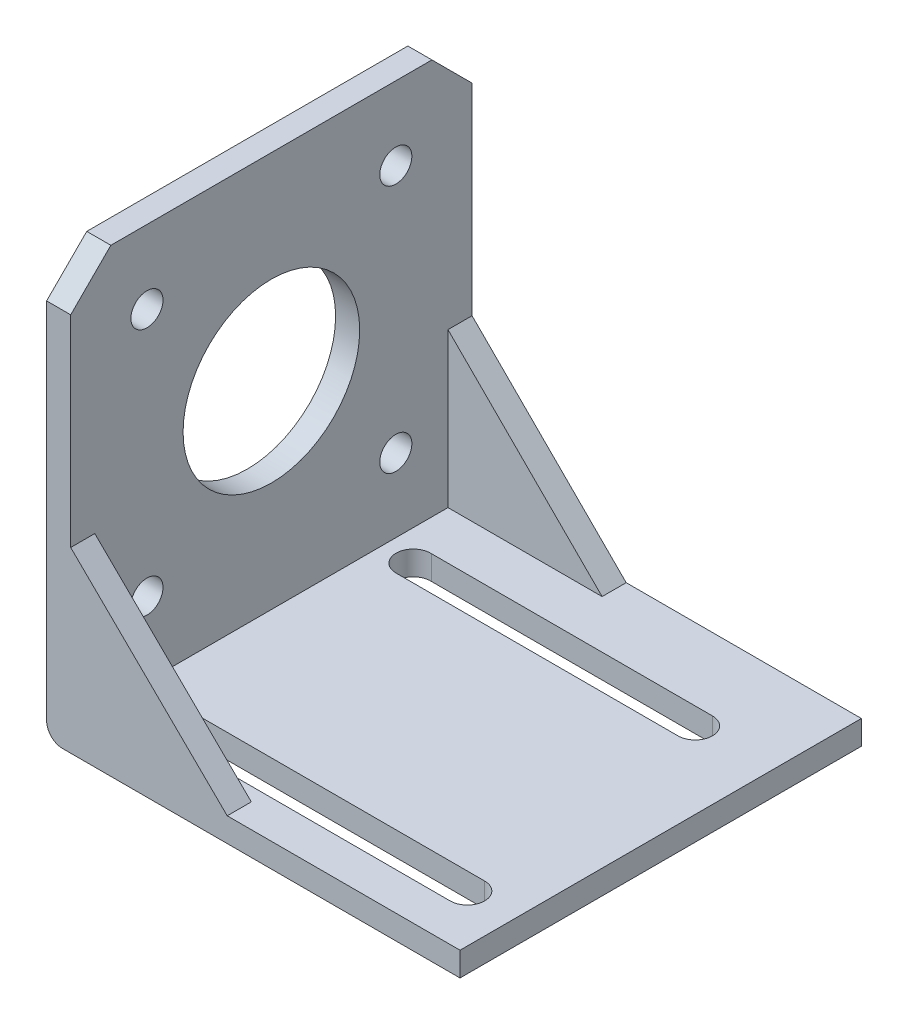
ISO-10303-21;
HEADER;
FILE_DESCRIPTION(('STEP AP214'),'2;1');
FILE_NAME('part.step','',(''),(''),'','','');
FILE_SCHEMA(('AUTOMOTIVE_DESIGN { 1 0 10303 214 1 1 1 1 }'));
ENDSEC;
DATA;
#1=APPLICATION_CONTEXT('core data for automotive mechanical design processes');
#2=APPLICATION_PROTOCOL_DEFINITION('international standard','automotive_design',2000,#1);
#3=PRODUCT_CONTEXT('',#1,'mechanical');
#4=PRODUCT('Part','Part','',(#3));
#5=PRODUCT_RELATED_PRODUCT_CATEGORY('part','',(#4));
#6=PRODUCT_DEFINITION_FORMATION('','',#4);
#7=PRODUCT_DEFINITION_CONTEXT('part definition',#1,'design');
#8=PRODUCT_DEFINITION('design','',#6,#7);
#9=PRODUCT_DEFINITION_SHAPE('','',#8);
#10=(LENGTH_UNIT() NAMED_UNIT(*) SI_UNIT(.MILLI.,.METRE.));
#11=(NAMED_UNIT(*) PLANE_ANGLE_UNIT() SI_UNIT($,.RADIAN.));
#12=(NAMED_UNIT(*) SI_UNIT($,.STERADIAN.) SOLID_ANGLE_UNIT());
#13=UNCERTAINTY_MEASURE_WITH_UNIT(LENGTH_MEASURE(1.E-05),#10,'distance_accuracy_value','');
#14=(GEOMETRIC_REPRESENTATION_CONTEXT(3) GLOBAL_UNCERTAINTY_ASSIGNED_CONTEXT((#13)) GLOBAL_UNIT_ASSIGNED_CONTEXT((#10,
#11,#12)) REPRESENTATION_CONTEXT('',''));
#15=CARTESIAN_POINT('',(0.,0.,0.));
#16=DIRECTION('',(0.,0.,1.));
#17=DIRECTION('',(1.,0.,0.));
#18=AXIS2_PLACEMENT_3D('',#15,#16,#17);
#19=CARTESIAN_POINT('',(48.5,0.,50.));
#20=DIRECTION('',(0.,-1.,0.));
#21=DIRECTION('',(1.,0.,0.));
#22=AXIS2_PLACEMENT_3D('',#19,#20,#21);
#23=PLANE('',#22);
#24=CARTESIAN_POINT('',(38.9492272097224,0.,11.15));
#25=DIRECTION('',(0.,-1.,0.));
#26=DIRECTION('',(1.,0.,0.));
#27=AXIS2_PLACEMENT_3D('',#24,#25,#26);
#28=CIRCLE('',#27,2.15);
#29=CARTESIAN_POINT('',(38.9492272097224,0.,13.3));
#30=VERTEX_POINT('',#29);
#31=CARTESIAN_POINT('',(38.9492272097224,0.,9.));
#32=VERTEX_POINT('',#31);
#33=EDGE_CURVE('E231',#30,#32,#28,.F.);
#34=ORIENTED_EDGE('',*,*,#33,.F.);
#35=DIRECTION('',(-1.,0.,0.));
#36=VECTOR('',#35,1.);
#37=CARTESIAN_POINT('',(48.5,0.,13.3));
#38=LINE('',#37,#36);
#39=CARTESIAN_POINT('',(3.82888231812455,0.,13.3));
#40=VERTEX_POINT('',#39);
#41=EDGE_CURVE('E234',#30,#40,#38,.T.);
#42=ORIENTED_EDGE('',*,*,#41,.T.);
#43=CARTESIAN_POINT('',(3.82888231812456,0.,11.1488570501058));
#44=DIRECTION('',(0.,-1.,0.));
#45=DIRECTION('',(1.,0.,0.));
#46=AXIS2_PLACEMENT_3D('',#43,#44,#45);
#47=CIRCLE('',#46,2.15114294989423);
#48=CARTESIAN_POINT('',(3.92802549282869,0.,9.));
#49=VERTEX_POINT('',#48);
#50=EDGE_CURVE('E222',#40,#49,#47,.T.);
#51=ORIENTED_EDGE('',*,*,#50,.T.);
#52=DIRECTION('',(-1.,0.,0.));
#53=VECTOR('',#52,1.);
#54=CARTESIAN_POINT('',(48.5,0.,9.));
#55=LINE('',#54,#53);
#56=EDGE_CURVE('E197',#32,#49,#55,.T.);
#57=ORIENTED_EDGE('',*,*,#56,.F.);
#58=EDGE_LOOP('',(#34,#42,#51,#57));
#59=FACE_BOUND('',#58,.T.);
#60=CARTESIAN_POINT('',(3.03967271372915,0.,43.15));
#61=DIRECTION('',(0.,-1.,0.));
#62=DIRECTION('',(1.,0.,0.));
#63=AXIS2_PLACEMENT_3D('',#60,#61,#62);
#64=CIRCLE('',#63,2.15);
#65=CARTESIAN_POINT('',(3.03967271372915,0.,45.3));
#66=VERTEX_POINT('',#65);
#67=CARTESIAN_POINT('',(3.03967271372916,0.,41.));
#68=VERTEX_POINT('',#67);
#69=EDGE_CURVE('E274',#66,#68,#64,.T.);
#70=ORIENTED_EDGE('',*,*,#69,.T.);
#71=DIRECTION('',(1.,0.,0.));
#72=VECTOR('',#71,1.);
#73=CARTESIAN_POINT('',(48.5,0.,41.));
#74=LINE('',#73,#72);
#75=CARTESIAN_POINT('',(42.5713713836583,0.,41.));
#76=VERTEX_POINT('',#75);
#77=EDGE_CURVE('E278',#68,#76,#74,.T.);
#78=ORIENTED_EDGE('',*,*,#77,.T.);
#79=CARTESIAN_POINT('',(42.5713713836583,0.,43.15));
#80=DIRECTION('',(0.,-1.,0.));
#81=DIRECTION('',(1.,0.,0.));
#82=AXIS2_PLACEMENT_3D('',#79,#80,#81);
#83=CIRCLE('',#82,2.15);
#84=CARTESIAN_POINT('',(42.5713713836583,0.,45.3));
#85=VERTEX_POINT('',#84);
#86=EDGE_CURVE('E257',#76,#85,#83,.T.);
#87=ORIENTED_EDGE('',*,*,#86,.T.);
#88=DIRECTION('',(1.,0.,0.));
#89=VECTOR('',#88,1.);
#90=CARTESIAN_POINT('',(48.5,0.,45.3));
#91=LINE('',#90,#89);
#92=EDGE_CURVE('E270',#66,#85,#91,.T.);
#93=ORIENTED_EDGE('',*,*,#92,.F.);
#94=EDGE_LOOP('',(#70,#78,#87,#93));
#95=FACE_BOUND('',#94,.T.);
#96=DIRECTION('',(-1.,0.,0.));
#97=VECTOR('',#96,1.);
#98=CARTESIAN_POINT('',(48.5,0.,0.));
#99=LINE('',#98,#97);
#100=CARTESIAN_POINT('',(48.5,0.,0.));
#101=VERTEX_POINT('',#100);
#102=CARTESIAN_POINT('',(19.2,0.,0.));
#103=VERTEX_POINT('',#102);
#104=EDGE_CURVE('E347',#101,#103,#99,.T.);
#105=ORIENTED_EDGE('',*,*,#104,.T.);
#106=DIRECTION('',(0.,0.,-1.));
#107=VECTOR('',#106,1.);
#108=CARTESIAN_POINT('',(19.2,0.,50.));
#109=LINE('',#108,#107);
#110=CARTESIAN_POINT('',(19.2,0.,3.));
#111=VERTEX_POINT('',#110);
#112=EDGE_CURVE('E317',#103,#111,#109,.F.);
#113=ORIENTED_EDGE('',*,*,#112,.T.);
#114=DIRECTION('',(-1.,0.,0.));
#115=VECTOR('',#114,1.);
#116=CARTESIAN_POINT('',(48.5,0.,3.));
#117=LINE('',#116,#115);
#118=CARTESIAN_POINT('',(0.,0.,3.));
#119=VERTEX_POINT('',#118);
#120=EDGE_CURVE('E323',#111,#119,#117,.T.);
#121=ORIENTED_EDGE('',*,*,#120,.T.);
#122=DIRECTION('',(0.,0.,-1.));
#123=VECTOR('',#122,1.);
#124=CARTESIAN_POINT('',(0.,0.,50.));
#125=LINE('',#124,#123);
#126=CARTESIAN_POINT('',(0.,0.,47.));
#127=VERTEX_POINT('',#126);
#128=EDGE_CURVE('E396',#127,#119,#125,.T.);
#129=ORIENTED_EDGE('',*,*,#128,.F.);
#130=DIRECTION('',(-1.,0.,0.));
#131=VECTOR('',#130,1.);
#132=CARTESIAN_POINT('',(48.5,0.,47.));
#133=LINE('',#132,#131);
#134=CARTESIAN_POINT('',(19.5,0.,47.));
#135=VERTEX_POINT('',#134);
#136=EDGE_CURVE('E344',#135,#127,#133,.T.);
#137=ORIENTED_EDGE('',*,*,#136,.F.);
#138=DIRECTION('',(0.,0.,-1.));
#139=VECTOR('',#138,1.);
#140=CARTESIAN_POINT('',(19.5,0.,50.));
#141=LINE('',#140,#139);
#142=CARTESIAN_POINT('',(19.5,0.,50.));
#143=VERTEX_POINT('',#142);
#144=EDGE_CURVE('E337',#135,#143,#141,.F.);
#145=ORIENTED_EDGE('',*,*,#144,.T.);
#146=DIRECTION('',(-1.,0.,0.));
#147=VECTOR('',#146,1.);
#148=CARTESIAN_POINT('',(48.5,0.,50.));
#149=LINE('',#148,#147);
#150=CARTESIAN_POINT('',(48.5,0.,50.));
#151=VERTEX_POINT('',#150);
#152=EDGE_CURVE('E348',#151,#143,#149,.T.);
#153=ORIENTED_EDGE('',*,*,#152,.F.);
#154=DIRECTION('',(0.,0.,-1.));
#155=VECTOR('',#154,1.);
#156=CARTESIAN_POINT('',(48.5,0.,50.));
#157=LINE('',#156,#155);
#158=EDGE_CURVE('E366',#151,#101,#157,.T.);
#159=ORIENTED_EDGE('',*,*,#158,.T.);
#160=EDGE_LOOP('',(#105,#113,#121,#129,#137,#145,#153,#159));
#161=FACE_BOUND('',#160,.T.);
#162=ADVANCED_FACE('F47',(#59,#95,#161),#23,.F.);
#163=CARTESIAN_POINT('',(0.,0.,50.));
#164=DIRECTION('',(-1.,0.,0.));
#165=DIRECTION('',(0.,-1.,0.));
#166=AXIS2_PLACEMENT_3D('',#163,#164,#165);
#167=PLANE('',#166);
#168=CARTESIAN_POINT('',(0.,40.15,9.49999999999999));
#169=DIRECTION('',(1.,0.,0.));
#170=DIRECTION('',(0.,1.,0.));
#171=AXIS2_PLACEMENT_3D('',#168,#169,#170);
#172=CIRCLE('',#171,2.);
#173=CARTESIAN_POINT('',(0.,42.15,9.49999999999999));
#174=VERTEX_POINT('',#173);
#175=EDGE_CURVE('E283',#174,#174,#172,.T.);
#176=ORIENTED_EDGE('',*,*,#175,.F.);
#177=EDGE_LOOP('',(#176));
#178=FACE_BOUND('',#177,.T.);
#179=CARTESIAN_POINT('',(0.,40.15,40.5));
#180=DIRECTION('',(1.,0.,0.));
#181=DIRECTION('',(0.,1.,0.));
#182=AXIS2_PLACEMENT_3D('',#179,#180,#181);
#183=CIRCLE('',#182,2.);
#184=CARTESIAN_POINT('',(0.,42.15,40.5));
#185=VERTEX_POINT('',#184);
#186=EDGE_CURVE('E288',#185,#185,#183,.T.);
#187=ORIENTED_EDGE('',*,*,#186,.F.);
#188=EDGE_LOOP('',(#187));
#189=FACE_BOUND('',#188,.T.);
#190=CARTESIAN_POINT('',(0.,9.15,9.49999999999999));
#191=DIRECTION('',(1.,0.,0.));
#192=DIRECTION('',(0.,1.,0.));
#193=AXIS2_PLACEMENT_3D('',#190,#191,#192);
#194=CIRCLE('',#193,2.);
#195=CARTESIAN_POINT('',(0.,11.15,9.49999999999999));
#196=VERTEX_POINT('',#195);
#197=EDGE_CURVE('E292',#196,#196,#194,.T.);
#198=ORIENTED_EDGE('',*,*,#197,.F.);
#199=EDGE_LOOP('',(#198));
#200=FACE_BOUND('',#199,.T.);
#201=CARTESIAN_POINT('',(0.,9.15,40.5));
#202=DIRECTION('',(1.,0.,0.));
#203=DIRECTION('',(0.,1.,0.));
#204=AXIS2_PLACEMENT_3D('',#201,#202,#203);
#205=CIRCLE('',#204,2.);
#206=CARTESIAN_POINT('',(0.,11.15,40.5));
#207=VERTEX_POINT('',#206);
#208=EDGE_CURVE('E282',#207,#207,#205,.T.);
#209=ORIENTED_EDGE('',*,*,#208,.F.);
#210=EDGE_LOOP('',(#209));
#211=FACE_BOUND('',#210,.T.);
#212=CARTESIAN_POINT('',(0.,24.65,25.));
#213=DIRECTION('',(1.,0.,0.));
#214=DIRECTION('',(0.,1.,0.));
#215=AXIS2_PLACEMENT_3D('',#212,#213,#214);
#216=CIRCLE('',#215,11.);
#217=CARTESIAN_POINT('',(0.,35.65,25.));
#218=VERTEX_POINT('',#217);
#219=EDGE_CURVE('E299',#218,#218,#216,.T.);
#220=ORIENTED_EDGE('',*,*,#219,.F.);
#221=EDGE_LOOP('',(#220));
#222=FACE_BOUND('',#221,.T.);
#223=DIRECTION('',(0.,1.,0.));
#224=VECTOR('',#223,1.);
#225=CARTESIAN_POINT('',(0.,0.,0.));
#226=LINE('',#225,#224);
#227=CARTESIAN_POINT('',(0.,19.2,0.));
#228=VERTEX_POINT('',#227);
#229=CARTESIAN_POINT('',(0.,44.3,0.));
#230=VERTEX_POINT('',#229);
#231=EDGE_CURVE('E369',#228,#230,#226,.T.);
#232=ORIENTED_EDGE('',*,*,#231,.T.);
#233=DIRECTION('',(0.,0.707106781186549,0.707106781186547));
#234=VECTOR('',#233,1.);
#235=CARTESIAN_POINT('',(0.,49.3,5.));
#236=LINE('',#235,#234);
#237=CARTESIAN_POINT('',(0.,49.3,5.));
#238=VERTEX_POINT('',#237);
#239=EDGE_CURVE('E56',#230,#238,#236,.T.);
#240=ORIENTED_EDGE('',*,*,#239,.T.);
#241=DIRECTION('',(0.,0.,-1.));
#242=VECTOR('',#241,1.);
#243=CARTESIAN_POINT('',(0.,49.3,50.));
#244=LINE('',#243,#242);
#245=CARTESIAN_POINT('',(0.,49.3,45.));
#246=VERTEX_POINT('',#245);
#247=EDGE_CURVE('E392',#246,#238,#244,.T.);
#248=ORIENTED_EDGE('',*,*,#247,.F.);
#249=DIRECTION('',(0.,0.707106781186546,-0.707106781186549));
#250=VECTOR('',#249,1.);
#251=CARTESIAN_POINT('',(0.,44.3,50.));
#252=LINE('',#251,#250);
#253=CARTESIAN_POINT('',(0.,44.3,50.));
#254=VERTEX_POINT('',#253);
#255=EDGE_CURVE('E448',#246,#254,#252,.F.);
#256=ORIENTED_EDGE('',*,*,#255,.T.);
#257=DIRECTION('',(0.,1.,0.));
#258=VECTOR('',#257,1.);
#259=CARTESIAN_POINT('',(0.,0.,50.));
#260=LINE('',#259,#258);
#261=CARTESIAN_POINT('',(0.,19.2,50.));
#262=VERTEX_POINT('',#261);
#263=EDGE_CURVE('E352',#262,#254,#260,.T.);
#264=ORIENTED_EDGE('',*,*,#263,.F.);
#265=DIRECTION('',(0.,0.,1.));
#266=VECTOR('',#265,1.);
#267=CARTESIAN_POINT('',(0.,19.2,50.));
#268=LINE('',#267,#266);
#269=CARTESIAN_POINT('',(0.,19.2,47.));
#270=VERTEX_POINT('',#269);
#271=EDGE_CURVE('E330',#262,#270,#268,.F.);
#272=ORIENTED_EDGE('',*,*,#271,.T.);
#273=DIRECTION('',(0.,1.,0.));
#274=VECTOR('',#273,1.);
#275=CARTESIAN_POINT('',(0.,0.,47.));
#276=LINE('',#275,#274);
#277=EDGE_CURVE('E341',#127,#270,#276,.T.);
#278=ORIENTED_EDGE('',*,*,#277,.F.);
#279=ORIENTED_EDGE('',*,*,#128,.T.);
#280=DIRECTION('',(0.,1.,0.));
#281=VECTOR('',#280,1.);
#282=CARTESIAN_POINT('',(0.,0.,3.));
#283=LINE('',#282,#281);
#284=CARTESIAN_POINT('',(0.,19.2,3.));
#285=VERTEX_POINT('',#284);
#286=EDGE_CURVE('E320',#119,#285,#283,.T.);
#287=ORIENTED_EDGE('',*,*,#286,.T.);
#288=DIRECTION('',(0.,0.,1.));
#289=VECTOR('',#288,1.);
#290=CARTESIAN_POINT('',(0.,19.2,50.));
#291=LINE('',#290,#289);
#292=EDGE_CURVE('E309',#285,#228,#291,.F.);
#293=ORIENTED_EDGE('',*,*,#292,.T.);
#294=EDGE_LOOP('',(#232,#240,#248,#256,#264,#272,#278,#279,#287,#293));
#295=FACE_BOUND('',#294,.T.);
#296=ADVANCED_FACE('F454',(#178,#189,#200,#211,#222,#295),#167,.F.);
#297=CARTESIAN_POINT('',(0.,49.3,50.));
#298=DIRECTION('',(0.,-1.,0.));
#299=DIRECTION('',(0.,0.,-1.));
#300=AXIS2_PLACEMENT_3D('',#297,#298,#299);
#301=PLANE('',#300);
#302=ORIENTED_EDGE('',*,*,#247,.T.);
#303=DIRECTION('',(-1.,0.,0.));
#304=VECTOR('',#303,1.);
#305=CARTESIAN_POINT('',(-3.,49.3,5.));
#306=LINE('',#305,#304);
#307=CARTESIAN_POINT('',(-3.,49.3,5.));
#308=VERTEX_POINT('',#307);
#309=EDGE_CURVE('E435',#238,#308,#306,.T.);
#310=ORIENTED_EDGE('',*,*,#309,.T.);
#311=DIRECTION('',(0.,0.,-1.));
#312=VECTOR('',#311,1.);
#313=CARTESIAN_POINT('',(-3.,49.3,50.));
#314=LINE('',#313,#312);
#315=CARTESIAN_POINT('',(-3.,49.3,45.));
#316=VERTEX_POINT('',#315);
#317=EDGE_CURVE('E388',#316,#308,#314,.T.);
#318=ORIENTED_EDGE('',*,*,#317,.F.);
#319=DIRECTION('',(1.,0.,0.));
#320=VECTOR('',#319,1.);
#321=CARTESIAN_POINT('',(0.,49.3,45.));
#322=LINE('',#321,#320);
#323=EDGE_CURVE('E415',#316,#246,#322,.T.);
#324=ORIENTED_EDGE('',*,*,#323,.T.);
#325=EDGE_LOOP('',(#302,#310,#318,#324));
#326=FACE_BOUND('',#325,.T.);
#327=ADVANCED_FACE('F460',(#326),#301,.F.);
#328=CARTESIAN_POINT('',(-3.,49.3,50.));
#329=DIRECTION('',(1.,0.,0.));
#330=DIRECTION('',(0.,1.,0.));
#331=AXIS2_PLACEMENT_3D('',#328,#329,#330);
#332=PLANE('',#331);
#333=CARTESIAN_POINT('',(-3.,40.15,9.49999999999999));
#334=DIRECTION('',(1.,0.,0.));
#335=DIRECTION('',(0.,1.,0.));
#336=AXIS2_PLACEMENT_3D('',#333,#334,#335);
#337=CIRCLE('',#336,2.);
#338=CARTESIAN_POINT('',(-3.,42.15,9.49999999999999));
#339=VERTEX_POINT('',#338);
#340=EDGE_CURVE('E304',#339,#339,#337,.T.);
#341=ORIENTED_EDGE('',*,*,#340,.T.);
#342=EDGE_LOOP('',(#341));
#343=FACE_BOUND('',#342,.T.);
#344=CARTESIAN_POINT('',(-3.,40.15,40.5));
#345=DIRECTION('',(1.,0.,0.));
#346=DIRECTION('',(0.,1.,0.));
#347=AXIS2_PLACEMENT_3D('',#344,#345,#346);
#348=CIRCLE('',#347,2.);
#349=CARTESIAN_POINT('',(-3.,42.15,40.5));
#350=VERTEX_POINT('',#349);
#351=EDGE_CURVE('E426',#350,#350,#348,.T.);
#352=ORIENTED_EDGE('',*,*,#351,.T.);
#353=EDGE_LOOP('',(#352));
#354=FACE_BOUND('',#353,.T.);
#355=CARTESIAN_POINT('',(-3.,9.15,9.49999999999999));
#356=DIRECTION('',(1.,0.,0.));
#357=DIRECTION('',(0.,1.,0.));
#358=AXIS2_PLACEMENT_3D('',#355,#356,#357);
#359=CIRCLE('',#358,2.);
#360=CARTESIAN_POINT('',(-3.,11.15,9.49999999999999));
#361=VERTEX_POINT('',#360);
#362=EDGE_CURVE('E422',#361,#361,#359,.T.);
#363=ORIENTED_EDGE('',*,*,#362,.T.);
#364=EDGE_LOOP('',(#363));
#365=FACE_BOUND('',#364,.T.);
#366=CARTESIAN_POINT('',(-3.,9.15,40.5));
#367=DIRECTION('',(1.,0.,0.));
#368=DIRECTION('',(0.,1.,0.));
#369=AXIS2_PLACEMENT_3D('',#366,#367,#368);
#370=CIRCLE('',#369,2.);
#371=CARTESIAN_POINT('',(-3.,11.15,40.5));
#372=VERTEX_POINT('',#371);
#373=EDGE_CURVE('E287',#372,#372,#370,.T.);
#374=ORIENTED_EDGE('',*,*,#373,.T.);
#375=EDGE_LOOP('',(#374));
#376=FACE_BOUND('',#375,.T.);
#377=CARTESIAN_POINT('',(-3.,24.65,25.));
#378=DIRECTION('',(1.,0.,0.));
#379=DIRECTION('',(0.,1.,0.));
#380=AXIS2_PLACEMENT_3D('',#377,#378,#379);
#381=CIRCLE('',#380,11.);
#382=CARTESIAN_POINT('',(-3.,35.65,25.));
#383=VERTEX_POINT('',#382);
#384=EDGE_CURVE('E303',#383,#383,#381,.T.);
#385=ORIENTED_EDGE('',*,*,#384,.T.);
#386=EDGE_LOOP('',(#385));
#387=FACE_BOUND('',#386,.T.);
#388=ORIENTED_EDGE('',*,*,#317,.T.);
#389=DIRECTION('',(0.,-0.707106781186549,-0.707106781186547));
#390=VECTOR('',#389,1.);
#391=CARTESIAN_POINT('',(-3.,49.3,5.));
#392=LINE('',#391,#390);
#393=CARTESIAN_POINT('',(-3.,44.3,0.));
#394=VERTEX_POINT('',#393);
#395=EDGE_CURVE('E442',#308,#394,#392,.T.);
#396=ORIENTED_EDGE('',*,*,#395,.T.);
#397=DIRECTION('',(0.,-1.,0.));
#398=VECTOR('',#397,1.);
#399=CARTESIAN_POINT('',(-3.,49.3,0.));
#400=LINE('',#399,#398);
#401=CARTESIAN_POINT('',(-3.,-1.,0.));
#402=VERTEX_POINT('',#401);
#403=EDGE_CURVE('E373',#394,#402,#400,.T.);
#404=ORIENTED_EDGE('',*,*,#403,.T.);
#405=DIRECTION('',(0.,0.,-1.));
#406=VECTOR('',#405,1.);
#407=CARTESIAN_POINT('',(-3.,-1.,50.));
#408=LINE('',#407,#406);
#409=CARTESIAN_POINT('',(-3.,-1.,50.));
#410=VERTEX_POINT('',#409);
#411=EDGE_CURVE('E408',#402,#410,#408,.F.);
#412=ORIENTED_EDGE('',*,*,#411,.T.);
#413=DIRECTION('',(0.,-1.,0.));
#414=VECTOR('',#413,1.);
#415=CARTESIAN_POINT('',(-3.,49.3,50.));
#416=LINE('',#415,#414);
#417=CARTESIAN_POINT('',(-3.,44.3,50.));
#418=VERTEX_POINT('',#417);
#419=EDGE_CURVE('E357',#418,#410,#416,.T.);
#420=ORIENTED_EDGE('',*,*,#419,.F.);
#421=DIRECTION('',(0.,-0.707106781186546,0.707106781186549));
#422=VECTOR('',#421,1.);
#423=CARTESIAN_POINT('',(-3.,44.3,50.));
#424=LINE('',#423,#422);
#425=EDGE_CURVE('E439',#418,#316,#424,.F.);
#426=ORIENTED_EDGE('',*,*,#425,.T.);
#427=EDGE_LOOP('',(#388,#396,#404,#412,#420,#426));
#428=FACE_BOUND('',#427,.T.);
#429=ADVANCED_FACE('F466',(#343,#354,#365,#376,#387,#428),#332,.F.);
#430=CARTESIAN_POINT('',(-3.,-3.,50.));
#431=DIRECTION('',(0.,1.,0.));
#432=DIRECTION('',(-1.,0.,0.));
#433=AXIS2_PLACEMENT_3D('',#430,#431,#432);
#434=PLANE('',#433);
#435=CARTESIAN_POINT('',(3.82888231812456,-3.,11.1488570501058));
#436=DIRECTION('',(0.,-1.,0.));
#437=DIRECTION('',(1.,0.,0.));
#438=AXIS2_PLACEMENT_3D('',#435,#436,#437);
#439=CIRCLE('',#438,2.15114294989423);
#440=CARTESIAN_POINT('',(3.82888231812456,-3.,13.3));
#441=VERTEX_POINT('',#440);
#442=CARTESIAN_POINT('',(3.9280254928287,-3.,9.));
#443=VERTEX_POINT('',#442);
#444=EDGE_CURVE('E204',#441,#443,#439,.T.);
#445=ORIENTED_EDGE('',*,*,#444,.F.);
#446=DIRECTION('',(-1.,0.,0.));
#447=VECTOR('',#446,1.);
#448=CARTESIAN_POINT('',(0.,-3.,13.3));
#449=LINE('',#448,#447);
#450=CARTESIAN_POINT('',(38.9492272097224,-2.99999999999999,13.3));
#451=VERTEX_POINT('',#450);
#452=EDGE_CURVE('E71',#451,#441,#449,.T.);
#453=ORIENTED_EDGE('',*,*,#452,.F.);
#454=CARTESIAN_POINT('',(38.9492272097224,-2.99999999999999,11.15));
#455=DIRECTION('',(0.,-1.,0.));
#456=DIRECTION('',(1.,0.,0.));
#457=AXIS2_PLACEMENT_3D('',#454,#455,#456);
#458=CIRCLE('',#457,2.15);
#459=CARTESIAN_POINT('',(38.9492272097224,-2.99999999999999,9.));
#460=VERTEX_POINT('',#459);
#461=EDGE_CURVE('E212',#451,#460,#458,.F.);
#462=ORIENTED_EDGE('',*,*,#461,.T.);
#463=DIRECTION('',(-1.,0.,0.));
#464=VECTOR('',#463,1.);
#465=CARTESIAN_POINT('',(0.,-3.,9.));
#466=LINE('',#465,#464);
#467=EDGE_CURVE('E194',#460,#443,#466,.T.);
#468=ORIENTED_EDGE('',*,*,#467,.T.);
#469=EDGE_LOOP('',(#445,#453,#462,#468));
#470=FACE_BOUND('',#469,.T.);
#471=CARTESIAN_POINT('',(42.5713713836583,-2.99999999999999,43.15));
#472=DIRECTION('',(0.,-1.,0.));
#473=DIRECTION('',(1.,0.,0.));
#474=AXIS2_PLACEMENT_3D('',#471,#472,#473);
#475=CIRCLE('',#474,2.15);
#476=CARTESIAN_POINT('',(42.5713713836583,-3.,41.));
#477=VERTEX_POINT('',#476);
#478=CARTESIAN_POINT('',(42.5713713836583,-2.99999999999999,45.3));
#479=VERTEX_POINT('',#478);
#480=EDGE_CURVE('E241',#477,#479,#475,.T.);
#481=ORIENTED_EDGE('',*,*,#480,.F.);
#482=DIRECTION('',(1.,0.,0.));
#483=VECTOR('',#482,1.);
#484=CARTESIAN_POINT('',(0.,-3.,41.));
#485=LINE('',#484,#483);
#486=CARTESIAN_POINT('',(3.03967271372916,-3.,41.));
#487=VERTEX_POINT('',#486);
#488=EDGE_CURVE('E238',#487,#477,#485,.T.);
#489=ORIENTED_EDGE('',*,*,#488,.F.);
#490=CARTESIAN_POINT('',(3.03967271372916,-3.,43.15));
#491=DIRECTION('',(0.,-1.,0.));
#492=DIRECTION('',(1.,0.,0.));
#493=AXIS2_PLACEMENT_3D('',#490,#491,#492);
#494=CIRCLE('',#493,2.15);
#495=CARTESIAN_POINT('',(3.03967271372915,-3.,45.3));
#496=VERTEX_POINT('',#495);
#497=EDGE_CURVE('E249',#496,#487,#494,.T.);
#498=ORIENTED_EDGE('',*,*,#497,.F.);
#499=DIRECTION('',(1.,0.,0.));
#500=VECTOR('',#499,1.);
#501=CARTESIAN_POINT('',(0.,-3.,45.3));
#502=LINE('',#501,#500);
#503=EDGE_CURVE('E245',#496,#479,#502,.T.);
#504=ORIENTED_EDGE('',*,*,#503,.T.);
#505=EDGE_LOOP('',(#481,#489,#498,#504));
#506=FACE_BOUND('',#505,.T.);
#507=DIRECTION('',(1.,0.,0.));
#508=VECTOR('',#507,1.);
#509=CARTESIAN_POINT('',(-3.,-3.,50.));
#510=LINE('',#509,#508);
#511=CARTESIAN_POINT('',(-0.999999999999998,-3.,50.));
#512=VERTEX_POINT('',#511);
#513=CARTESIAN_POINT('',(48.5,-2.99999999999999,50.));
#514=VERTEX_POINT('',#513);
#515=EDGE_CURVE('E360',#512,#514,#510,.T.);
#516=ORIENTED_EDGE('',*,*,#515,.F.);
#517=DIRECTION('',(0.,0.,-1.));
#518=VECTOR('',#517,1.);
#519=CARTESIAN_POINT('',(-0.999999999999997,-3.,50.));
#520=LINE('',#519,#518);
#521=CARTESIAN_POINT('',(-0.999999999999998,-3.,0.));
#522=VERTEX_POINT('',#521);
#523=EDGE_CURVE('E400',#512,#522,#520,.T.);
#524=ORIENTED_EDGE('',*,*,#523,.T.);
#525=DIRECTION('',(1.,0.,0.));
#526=VECTOR('',#525,1.);
#527=CARTESIAN_POINT('',(-3.,-3.,0.));
#528=LINE('',#527,#526);
#529=CARTESIAN_POINT('',(48.5,-2.99999999999999,0.));
#530=VERTEX_POINT('',#529);
#531=EDGE_CURVE('E376',#522,#530,#528,.T.);
#532=ORIENTED_EDGE('',*,*,#531,.T.);
#533=DIRECTION('',(0.,0.,-1.));
#534=VECTOR('',#533,1.);
#535=CARTESIAN_POINT('',(48.5,-2.99999999999999,50.));
#536=LINE('',#535,#534);
#537=EDGE_CURVE('E384',#514,#530,#536,.T.);
#538=ORIENTED_EDGE('',*,*,#537,.F.);
#539=EDGE_LOOP('',(#516,#524,#532,#538));
#540=FACE_BOUND('',#539,.T.);
#541=ADVANCED_FACE('F209',(#470,#506,#540),#434,.F.);
#542=CARTESIAN_POINT('',(48.5,-2.99999999999999,50.));
#543=DIRECTION('',(-1.,0.,0.));
#544=DIRECTION('',(0.,0.,1.));
#545=AXIS2_PLACEMENT_3D('',#542,#543,#544);
#546=PLANE('',#545);
#547=DIRECTION('',(0.,1.,0.));
#548=VECTOR('',#547,1.);
#549=CARTESIAN_POINT('',(48.5,-2.99999999999999,0.));
#550=LINE('',#549,#548);
#551=EDGE_CURVE('E353',#530,#101,#550,.T.);
#552=ORIENTED_EDGE('',*,*,#551,.T.);
#553=ORIENTED_EDGE('',*,*,#158,.F.);
#554=DIRECTION('',(0.,1.,0.));
#555=VECTOR('',#554,1.);
#556=CARTESIAN_POINT('',(48.5,-2.99999999999999,50.));
#557=LINE('',#556,#555);
#558=EDGE_CURVE('E363',#514,#151,#557,.T.);
#559=ORIENTED_EDGE('',*,*,#558,.F.);
#560=ORIENTED_EDGE('',*,*,#537,.T.);
#561=EDGE_LOOP('',(#552,#553,#559,#560));
#562=FACE_BOUND('',#561,.T.);
#563=ADVANCED_FACE('F508',(#562),#546,.F.);
#564=CARTESIAN_POINT('',(0.,0.,50.));
#565=DIRECTION('',(0.,0.,-1.));
#566=DIRECTION('',(-1.,0.,0.));
#567=AXIS2_PLACEMENT_3D('',#564,#565,#566);
#568=PLANE('',#567);
#569=ORIENTED_EDGE('',*,*,#263,.T.);
#570=DIRECTION('',(-1.,0.,0.));
#571=VECTOR('',#570,1.);
#572=CARTESIAN_POINT('',(0.,44.3,50.));
#573=LINE('',#572,#571);
#574=EDGE_CURVE('E11',#254,#418,#573,.T.);
#575=ORIENTED_EDGE('',*,*,#574,.T.);
#576=ORIENTED_EDGE('',*,*,#419,.T.);
#577=CARTESIAN_POINT('',(-0.999999999999997,-1.,50.));
#578=DIRECTION('',(0.,0.,-1.));
#579=DIRECTION('',(-1.,0.,0.));
#580=AXIS2_PLACEMENT_3D('',#577,#578,#579);
#581=CIRCLE('',#580,2.);
#582=EDGE_CURVE('E412',#410,#512,#581,.F.);
#583=ORIENTED_EDGE('',*,*,#582,.T.);
#584=ORIENTED_EDGE('',*,*,#515,.T.);
#585=ORIENTED_EDGE('',*,*,#558,.T.);
#586=ORIENTED_EDGE('',*,*,#152,.T.);
#587=DIRECTION('',(0.712566819448411,-0.701604252995359,0.));
#588=VECTOR('',#587,1.);
#589=CARTESIAN_POINT('',(0.,19.2,50.));
#590=LINE('',#589,#588);
#591=EDGE_CURVE('E327',#262,#143,#590,.T.);
#592=ORIENTED_EDGE('',*,*,#591,.F.);
#593=EDGE_LOOP('',(#569,#575,#576,#583,#584,#585,#586,#592));
#594=FACE_BOUND('',#593,.T.);
#595=ADVANCED_FACE('F478',(#594),#568,.F.);
#596=CARTESIAN_POINT('',(0.,0.,0.));
#597=DIRECTION('',(0.,0.,-1.));
#598=DIRECTION('',(-1.,0.,0.));
#599=AXIS2_PLACEMENT_3D('',#596,#597,#598);
#600=PLANE('',#599);
#601=ORIENTED_EDGE('',*,*,#403,.F.);
#602=DIRECTION('',(1.,0.,0.));
#603=VECTOR('',#602,1.);
#604=CARTESIAN_POINT('',(0.,44.3,0.));
#605=LINE('',#604,#603);
#606=EDGE_CURVE('E445',#394,#230,#605,.T.);
#607=ORIENTED_EDGE('',*,*,#606,.T.);
#608=ORIENTED_EDGE('',*,*,#231,.F.);
#609=DIRECTION('',(0.707106781186548,-0.707106781186547,0.));
#610=VECTOR('',#609,1.);
#611=CARTESIAN_POINT('',(0.,19.2,0.));
#612=LINE('',#611,#610);
#613=EDGE_CURVE('E310',#228,#103,#612,.T.);
#614=ORIENTED_EDGE('',*,*,#613,.T.);
#615=ORIENTED_EDGE('',*,*,#104,.F.);
#616=ORIENTED_EDGE('',*,*,#551,.F.);
#617=ORIENTED_EDGE('',*,*,#531,.F.);
#618=CARTESIAN_POINT('',(-0.999999999999997,-1.,0.));
#619=DIRECTION('',(0.,0.,-1.));
#620=DIRECTION('',(-1.,0.,0.));
#621=AXIS2_PLACEMENT_3D('',#618,#619,#620);
#622=CIRCLE('',#621,2.);
#623=EDGE_CURVE('E404',#522,#402,#622,.T.);
#624=ORIENTED_EDGE('',*,*,#623,.T.);
#625=EDGE_LOOP('',(#601,#607,#608,#614,#615,#616,#617,#624));
#626=FACE_BOUND('',#625,.T.);
#627=ADVANCED_FACE('F468',(#626),#600,.T.);
#628=CARTESIAN_POINT('',(22.75,23.15,47.));
#629=DIRECTION('',(0.,0.,1.));
#630=DIRECTION('',(1.,0.,0.));
#631=AXIS2_PLACEMENT_3D('',#628,#629,#630);
#632=PLANE('',#631);
#633=DIRECTION('',(0.712566819448411,-0.701604252995359,0.));
#634=VECTOR('',#633,1.);
#635=CARTESIAN_POINT('',(0.,19.2,47.));
#636=LINE('',#635,#634);
#637=EDGE_CURVE('E326',#270,#135,#636,.T.);
#638=ORIENTED_EDGE('',*,*,#637,.T.);
#639=ORIENTED_EDGE('',*,*,#136,.T.);
#640=ORIENTED_EDGE('',*,*,#277,.T.);
#641=EDGE_LOOP('',(#638,#639,#640));
#642=FACE_BOUND('',#641,.T.);
#643=ADVANCED_FACE('F491',(#642),#632,.F.);
#644=CARTESIAN_POINT('',(0.,19.2,50.));
#645=DIRECTION('',(-0.701604252995359,-0.712566819448411,0.));
#646=DIRECTION('',(0.712566819448411,-0.701604252995359,0.));
#647=AXIS2_PLACEMENT_3D('',#644,#645,#646);
#648=PLANE('',#647);
#649=ORIENTED_EDGE('',*,*,#144,.F.);
#650=ORIENTED_EDGE('',*,*,#637,.F.);
#651=ORIENTED_EDGE('',*,*,#271,.F.);
#652=ORIENTED_EDGE('',*,*,#591,.T.);
#653=EDGE_LOOP('',(#649,#650,#651,#652));
#654=FACE_BOUND('',#653,.T.);
#655=ADVANCED_FACE('F488',(#654),#648,.F.);
#656=CARTESIAN_POINT('',(22.75,23.15,3.));
#657=DIRECTION('',(0.,0.,1.));
#658=DIRECTION('',(1.,0.,0.));
#659=AXIS2_PLACEMENT_3D('',#656,#657,#658);
#660=PLANE('',#659);
#661=ORIENTED_EDGE('',*,*,#120,.F.);
#662=DIRECTION('',(0.707106781186548,-0.707106781186547,0.));
#663=VECTOR('',#662,1.);
#664=CARTESIAN_POINT('',(0.,19.2,3.));
#665=LINE('',#664,#663);
#666=EDGE_CURVE('E305',#285,#111,#665,.T.);
#667=ORIENTED_EDGE('',*,*,#666,.F.);
#668=ORIENTED_EDGE('',*,*,#286,.F.);
#669=EDGE_LOOP('',(#661,#667,#668));
#670=FACE_BOUND('',#669,.T.);
#671=ADVANCED_FACE('F499',(#670),#660,.T.);
#672=CARTESIAN_POINT('',(0.,19.2,0.));
#673=DIRECTION('',(-0.707106781186547,-0.707106781186548,0.));
#674=DIRECTION('',(0.707106781186548,-0.707106781186547,0.));
#675=AXIS2_PLACEMENT_3D('',#672,#673,#674);
#676=PLANE('',#675);
#677=ORIENTED_EDGE('',*,*,#112,.F.);
#678=ORIENTED_EDGE('',*,*,#613,.F.);
#679=ORIENTED_EDGE('',*,*,#292,.F.);
#680=ORIENTED_EDGE('',*,*,#666,.T.);
#681=EDGE_LOOP('',(#677,#678,#679,#680));
#682=FACE_BOUND('',#681,.T.);
#683=ADVANCED_FACE('F502',(#682),#676,.F.);
#684=CARTESIAN_POINT('',(-0.999999999999997,-1.,50.));
#685=DIRECTION('',(0.,0.,-1.));
#686=DIRECTION('',(-1.,0.,0.));
#687=AXIS2_PLACEMENT_3D('',#684,#685,#686);
#688=CYLINDRICAL_SURFACE('',#687,2.);
#689=ORIENTED_EDGE('',*,*,#582,.F.);
#690=ORIENTED_EDGE('',*,*,#411,.F.);
#691=ORIENTED_EDGE('',*,*,#623,.F.);
#692=ORIENTED_EDGE('',*,*,#523,.F.);
#693=EDGE_LOOP('',(#689,#690,#691,#692));
#694=FACE_BOUND('',#693,.T.);
#695=ADVANCED_FACE('F475',(#694),#688,.T.);
#696=CARTESIAN_POINT('',(-50.,24.65,25.));
#697=DIRECTION('',(1.,0.,0.));
#698=DIRECTION('',(0.,1.,0.));
#699=AXIS2_PLACEMENT_3D('',#696,#697,#698);
#700=CYLINDRICAL_SURFACE('',#699,11.);
#701=ORIENTED_EDGE('',*,*,#219,.T.);
#702=EDGE_LOOP('',(#701));
#703=FACE_BOUND('',#702,.T.);
#704=ORIENTED_EDGE('',*,*,#384,.F.);
#705=EDGE_LOOP('',(#704));
#706=FACE_BOUND('',#705,.T.);
#707=ADVANCED_FACE('F535',(#703,#706),#700,.F.);
#708=CARTESIAN_POINT('',(-50.,9.15,40.5));
#709=DIRECTION('',(1.,0.,0.));
#710=DIRECTION('',(0.,1.,0.));
#711=AXIS2_PLACEMENT_3D('',#708,#709,#710);
#712=CYLINDRICAL_SURFACE('',#711,2.);
#713=ORIENTED_EDGE('',*,*,#208,.T.);
#714=EDGE_LOOP('',(#713));
#715=FACE_BOUND('',#714,.T.);
#716=ORIENTED_EDGE('',*,*,#373,.F.);
#717=EDGE_LOOP('',(#716));
#718=FACE_BOUND('',#717,.T.);
#719=ADVANCED_FACE('F558',(#715,#718),#712,.F.);
#720=CARTESIAN_POINT('',(-50.,9.15,9.49999999999999));
#721=DIRECTION('',(1.,0.,0.));
#722=DIRECTION('',(0.,1.,0.));
#723=AXIS2_PLACEMENT_3D('',#720,#721,#722);
#724=CYLINDRICAL_SURFACE('',#723,2.);
#725=ORIENTED_EDGE('',*,*,#197,.T.);
#726=EDGE_LOOP('',(#725));
#727=FACE_BOUND('',#726,.T.);
#728=ORIENTED_EDGE('',*,*,#362,.F.);
#729=EDGE_LOOP('',(#728));
#730=FACE_BOUND('',#729,.T.);
#731=ADVANCED_FACE('F549',(#727,#730),#724,.F.);
#732=CARTESIAN_POINT('',(-50.,40.15,40.5));
#733=DIRECTION('',(1.,0.,0.));
#734=DIRECTION('',(0.,1.,0.));
#735=AXIS2_PLACEMENT_3D('',#732,#733,#734);
#736=CYLINDRICAL_SURFACE('',#735,2.);
#737=ORIENTED_EDGE('',*,*,#186,.T.);
#738=EDGE_LOOP('',(#737));
#739=FACE_BOUND('',#738,.T.);
#740=ORIENTED_EDGE('',*,*,#351,.F.);
#741=EDGE_LOOP('',(#740));
#742=FACE_BOUND('',#741,.T.);
#743=ADVANCED_FACE('F543',(#739,#742),#736,.F.);
#744=CARTESIAN_POINT('',(-50.,40.15,9.49999999999999));
#745=DIRECTION('',(1.,0.,0.));
#746=DIRECTION('',(0.,1.,0.));
#747=AXIS2_PLACEMENT_3D('',#744,#745,#746);
#748=CYLINDRICAL_SURFACE('',#747,2.);
#749=ORIENTED_EDGE('',*,*,#175,.T.);
#750=EDGE_LOOP('',(#749));
#751=FACE_BOUND('',#750,.T.);
#752=ORIENTED_EDGE('',*,*,#340,.F.);
#753=EDGE_LOOP('',(#752));
#754=FACE_BOUND('',#753,.T.);
#755=ADVANCED_FACE('F537',(#751,#754),#748,.F.);
#756=CARTESIAN_POINT('',(0.,49.3,5.));
#757=DIRECTION('',(0.,0.707106781186547,-0.707106781186549));
#758=DIRECTION('',(1.,0.,0.));
#759=AXIS2_PLACEMENT_3D('',#756,#757,#758);
#760=PLANE('',#759);
#761=ORIENTED_EDGE('',*,*,#239,.F.);
#762=ORIENTED_EDGE('',*,*,#606,.F.);
#763=ORIENTED_EDGE('',*,*,#395,.F.);
#764=ORIENTED_EDGE('',*,*,#309,.F.);
#765=EDGE_LOOP('',(#761,#762,#763,#764));
#766=FACE_BOUND('',#765,.T.);
#767=ADVANCED_FACE('F463',(#766),#760,.T.);
#768=CARTESIAN_POINT('',(0.,44.3,50.));
#769=DIRECTION('',(0.,-0.707106781186549,-0.707106781186545));
#770=DIRECTION('',(-1.,0.,0.));
#771=AXIS2_PLACEMENT_3D('',#768,#769,#770);
#772=PLANE('',#771);
#773=ORIENTED_EDGE('',*,*,#255,.F.);
#774=ORIENTED_EDGE('',*,*,#323,.F.);
#775=ORIENTED_EDGE('',*,*,#425,.F.);
#776=ORIENTED_EDGE('',*,*,#574,.F.);
#777=EDGE_LOOP('',(#773,#774,#775,#776));
#778=FACE_BOUND('',#777,.T.);
#779=ADVANCED_FACE('F49',(#778),#772,.F.);
#780=CARTESIAN_POINT('',(0.,47.,41.));
#781=DIRECTION('',(0.,0.,-1.));
#782=DIRECTION('',(-1.,0.,0.));
#783=AXIS2_PLACEMENT_3D('',#780,#781,#782);
#784=PLANE('',#783);
#785=DIRECTION('',(0.,-1.,0.));
#786=VECTOR('',#785,1.);
#787=CARTESIAN_POINT('',(3.03967271372915,47.,41.));
#788=LINE('',#787,#786);
#789=EDGE_CURVE('E254',#68,#487,#788,.T.);
#790=ORIENTED_EDGE('',*,*,#789,.T.);
#791=ORIENTED_EDGE('',*,*,#488,.T.);
#792=DIRECTION('',(0.,-1.,0.));
#793=VECTOR('',#792,1.);
#794=CARTESIAN_POINT('',(42.5713713836583,47.,41.));
#795=LINE('',#794,#793);
#796=EDGE_CURVE('E253',#76,#477,#795,.T.);
#797=ORIENTED_EDGE('',*,*,#796,.F.);
#798=ORIENTED_EDGE('',*,*,#77,.F.);
#799=EDGE_LOOP('',(#790,#791,#797,#798));
#800=FACE_BOUND('',#799,.T.);
#801=ADVANCED_FACE('F541',(#800),#784,.F.);
#802=CARTESIAN_POINT('',(3.03967271372915,47.,43.15));
#803=DIRECTION('',(0.,-1.,0.));
#804=DIRECTION('',(1.,0.,0.));
#805=AXIS2_PLACEMENT_3D('',#802,#803,#804);
#806=CYLINDRICAL_SURFACE('',#805,2.15);
#807=DIRECTION('',(0.,-1.,0.));
#808=VECTOR('',#807,1.);
#809=CARTESIAN_POINT('',(3.03967271372915,47.,45.3));
#810=LINE('',#809,#808);
#811=EDGE_CURVE('E258',#66,#496,#810,.T.);
#812=ORIENTED_EDGE('',*,*,#811,.T.);
#813=ORIENTED_EDGE('',*,*,#497,.T.);
#814=ORIENTED_EDGE('',*,*,#789,.F.);
#815=ORIENTED_EDGE('',*,*,#69,.F.);
#816=EDGE_LOOP('',(#812,#813,#814,#815));
#817=FACE_BOUND('',#816,.T.);
#818=ADVANCED_FACE('F688',(#817),#806,.F.);
#819=CARTESIAN_POINT('',(0.,47.,45.3));
#820=DIRECTION('',(0.,0.,-1.));
#821=DIRECTION('',(-1.,0.,0.));
#822=AXIS2_PLACEMENT_3D('',#819,#820,#821);
#823=PLANE('',#822);
#824=ORIENTED_EDGE('',*,*,#92,.T.);
#825=DIRECTION('',(0.,-1.,0.));
#826=VECTOR('',#825,1.);
#827=CARTESIAN_POINT('',(42.5713713836583,47.,45.3));
#828=LINE('',#827,#826);
#829=EDGE_CURVE('E261',#85,#479,#828,.T.);
#830=ORIENTED_EDGE('',*,*,#829,.T.);
#831=ORIENTED_EDGE('',*,*,#503,.F.);
#832=ORIENTED_EDGE('',*,*,#811,.F.);
#833=EDGE_LOOP('',(#824,#830,#831,#832));
#834=FACE_BOUND('',#833,.T.);
#835=ADVANCED_FACE('F696',(#834),#823,.T.);
#836=CARTESIAN_POINT('',(42.5713713836583,47.,43.15));
#837=DIRECTION('',(0.,-1.,0.));
#838=DIRECTION('',(1.,0.,0.));
#839=AXIS2_PLACEMENT_3D('',#836,#837,#838);
#840=CYLINDRICAL_SURFACE('',#839,2.15);
#841=ORIENTED_EDGE('',*,*,#796,.T.);
#842=ORIENTED_EDGE('',*,*,#480,.T.);
#843=ORIENTED_EDGE('',*,*,#829,.F.);
#844=ORIENTED_EDGE('',*,*,#86,.F.);
#845=EDGE_LOOP('',(#841,#842,#843,#844));
#846=FACE_BOUND('',#845,.T.);
#847=ADVANCED_FACE('F705',(#846),#840,.F.);
#848=CARTESIAN_POINT('',(0.,47.,13.3));
#849=DIRECTION('',(0.,0.,1.));
#850=DIRECTION('',(1.,0.,0.));
#851=AXIS2_PLACEMENT_3D('',#848,#849,#850);
#852=PLANE('',#851);
#853=DIRECTION('',(0.,-1.,0.));
#854=VECTOR('',#853,1.);
#855=CARTESIAN_POINT('',(38.9492272097224,47.,13.3));
#856=LINE('',#855,#854);
#857=EDGE_CURVE('E219',#30,#451,#856,.T.);
#858=ORIENTED_EDGE('',*,*,#857,.T.);
#859=ORIENTED_EDGE('',*,*,#452,.T.);
#860=DIRECTION('',(0.,-1.,0.));
#861=VECTOR('',#860,1.);
#862=CARTESIAN_POINT('',(3.82888231812455,47.,13.3));
#863=LINE('',#862,#861);
#864=EDGE_CURVE('E201',#40,#441,#863,.T.);
#865=ORIENTED_EDGE('',*,*,#864,.F.);
#866=ORIENTED_EDGE('',*,*,#41,.F.);
#867=EDGE_LOOP('',(#858,#859,#865,#866));
#868=FACE_BOUND('',#867,.T.);
#869=ADVANCED_FACE('F714',(#868),#852,.F.);
#870=CARTESIAN_POINT('',(38.9492272097224,47.,11.15));
#871=DIRECTION('',(0.,-1.,0.));
#872=DIRECTION('',(1.,0.,0.));
#873=AXIS2_PLACEMENT_3D('',#870,#871,#872);
#874=CYLINDRICAL_SURFACE('',#873,2.15);
#875=ORIENTED_EDGE('',*,*,#33,.T.);
#876=DIRECTION('',(0.,-1.,0.));
#877=VECTOR('',#876,1.);
#878=CARTESIAN_POINT('',(38.9492272097224,47.,9.));
#879=LINE('',#878,#877);
#880=EDGE_CURVE('E200',#32,#460,#879,.T.);
#881=ORIENTED_EDGE('',*,*,#880,.T.);
#882=ORIENTED_EDGE('',*,*,#461,.F.);
#883=ORIENTED_EDGE('',*,*,#857,.F.);
#884=EDGE_LOOP('',(#875,#881,#882,#883));
#885=FACE_BOUND('',#884,.T.);
#886=ADVANCED_FACE('F722',(#885),#874,.F.);
#887=CARTESIAN_POINT('',(0.,47.,9.));
#888=DIRECTION('',(0.,0.,1.));
#889=DIRECTION('',(1.,0.,0.));
#890=AXIS2_PLACEMENT_3D('',#887,#888,#889);
#891=PLANE('',#890);
#892=ORIENTED_EDGE('',*,*,#56,.T.);
#893=DIRECTION('',(0.,-1.,0.));
#894=VECTOR('',#893,1.);
#895=CARTESIAN_POINT('',(3.92802549282869,47.,9.));
#896=LINE('',#895,#894);
#897=EDGE_CURVE('E63',#49,#443,#896,.T.);
#898=ORIENTED_EDGE('',*,*,#897,.T.);
#899=ORIENTED_EDGE('',*,*,#467,.F.);
#900=ORIENTED_EDGE('',*,*,#880,.F.);
#901=EDGE_LOOP('',(#892,#898,#899,#900));
#902=FACE_BOUND('',#901,.T.);
#903=ADVANCED_FACE('F191',(#902),#891,.T.);
#904=CARTESIAN_POINT('',(3.82888231812455,47.,11.1488570501058));
#905=DIRECTION('',(0.,-1.,0.));
#906=DIRECTION('',(1.,0.,0.));
#907=AXIS2_PLACEMENT_3D('',#904,#905,#906);
#908=CYLINDRICAL_SURFACE('',#907,2.15114294989423);
#909=ORIENTED_EDGE('',*,*,#864,.T.);
#910=ORIENTED_EDGE('',*,*,#444,.T.);
#911=ORIENTED_EDGE('',*,*,#897,.F.);
#912=ORIENTED_EDGE('',*,*,#50,.F.);
#913=EDGE_LOOP('',(#909,#910,#911,#912));
#914=FACE_BOUND('',#913,.T.);
#915=ADVANCED_FACE('F205',(#914),#908,.F.);
#916=CLOSED_SHELL('',(#162,#296,#327,#429,#541,#563,#595,#627,#643,#655,#671,#683,#695,#707,
#719,#731,#743,#755,#767,#779,#801,#818,#835,#847,#869,#886,#903,#915));
#917=MANIFOLD_SOLID_BREP('B2',#916);
#918=ADVANCED_BREP_SHAPE_REPRESENTATION('',(#18,#917),#14);
#919=SHAPE_DEFINITION_REPRESENTATION(#9,#918);
ENDSEC;
END-ISO-10303-21;
